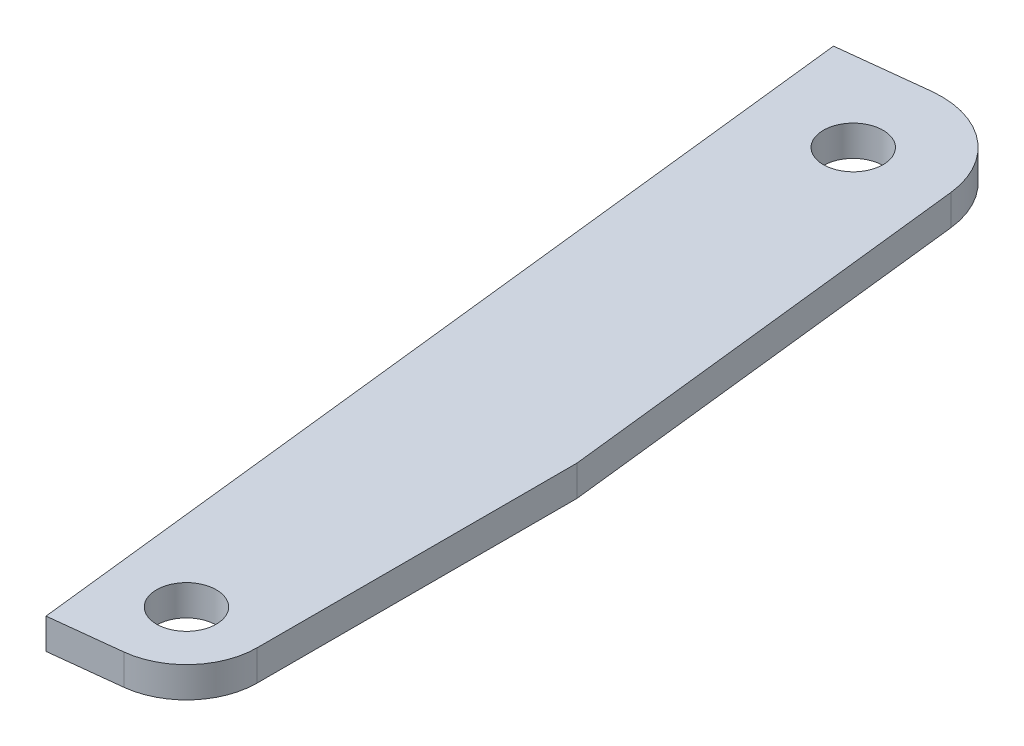
ISO-10303-21;
HEADER;
FILE_DESCRIPTION(('STEP AP214'),'2;1');
FILE_NAME('part.step','',(''),(''),'','','');
FILE_SCHEMA(('AUTOMOTIVE_DESIGN { 1 0 10303 214 1 1 1 1 }'));
ENDSEC;
DATA;
#1=APPLICATION_CONTEXT('core data for automotive mechanical design processes');
#2=APPLICATION_PROTOCOL_DEFINITION('international standard','automotive_design',2000,#1);
#3=PRODUCT_CONTEXT('',#1,'mechanical');
#4=PRODUCT('Part','Part','',(#3));
#5=PRODUCT_RELATED_PRODUCT_CATEGORY('part','',(#4));
#6=PRODUCT_DEFINITION_FORMATION('','',#4);
#7=PRODUCT_DEFINITION_CONTEXT('part definition',#1,'design');
#8=PRODUCT_DEFINITION('design','',#6,#7);
#9=PRODUCT_DEFINITION_SHAPE('','',#8);
#10=(LENGTH_UNIT() NAMED_UNIT(*) SI_UNIT(.MILLI.,.METRE.));
#11=(NAMED_UNIT(*) PLANE_ANGLE_UNIT() SI_UNIT($,.RADIAN.));
#12=(NAMED_UNIT(*) SI_UNIT($,.STERADIAN.) SOLID_ANGLE_UNIT());
#13=UNCERTAINTY_MEASURE_WITH_UNIT(LENGTH_MEASURE(1.E-05),#10,'distance_accuracy_value','');
#14=(GEOMETRIC_REPRESENTATION_CONTEXT(3) GLOBAL_UNCERTAINTY_ASSIGNED_CONTEXT((#13)) GLOBAL_UNIT_ASSIGNED_CONTEXT((#10,
#11,#12)) REPRESENTATION_CONTEXT('',''));
#15=CARTESIAN_POINT('',(0.,0.,0.));
#16=DIRECTION('',(0.,0.,1.));
#17=DIRECTION('',(1.,0.,0.));
#18=AXIS2_PLACEMENT_3D('',#15,#16,#17);
#19=CARTESIAN_POINT('',(-15.9902564771226,-15.2624999999999,81.9598120914848));
#20=DIRECTION('',(0.,1.,0.));
#21=DIRECTION('',(0.,0.,1.));
#22=AXIS2_PLACEMENT_3D('',#19,#20,#21);
#23=PLANE('',#22);
#24=CARTESIAN_POINT('',(-17.3400495431374,-15.2624999999999,56.0398397293865));
#25=DIRECTION('',(0.,1.,0.));
#26=DIRECTION('',(0.,0.,1.));
#27=AXIS2_PLACEMENT_3D('',#24,#25,#26);
#28=CIRCLE('',#27,2.1463);
#29=CARTESIAN_POINT('',(-17.3400495431374,-15.2624999999999,58.1861397293865));
#30=VERTEX_POINT('',#29);
#31=EDGE_CURVE('E97',#30,#30,#28,.T.);
#32=ORIENTED_EDGE('',*,*,#31,.T.);
#33=EDGE_LOOP('',(#32));
#34=FACE_BOUND('',#33,.T.);
#35=CARTESIAN_POINT('',(-12.7000000000016,-15.2624999999999,108.613413739759));
#36=DIRECTION('',(0.,1.,0.));
#37=DIRECTION('',(0.,0.,1.));
#38=AXIS2_PLACEMENT_3D('',#35,#36,#37);
#39=CIRCLE('',#38,2.1463);
#40=CARTESIAN_POINT('',(-12.7000000000016,-15.2624999999999,110.759713739759));
#41=VERTEX_POINT('',#40);
#42=EDGE_CURVE('E104',#41,#41,#39,.T.);
#43=ORIENTED_EDGE('',*,*,#42,.T.);
#44=EDGE_LOOP('',(#43));
#45=FACE_BOUND('',#44,.T.);
#46=DIRECTION('',(0.993723873054751,0.,-0.111860914179466));
#47=VECTOR('',#46,1.);
#48=CARTESIAN_POINT('',(-12.1317465559698,-15.2624999999999,113.661531014878));
#49=LINE('',#48,#47);
#50=CARTESIAN_POINT('',(-17.179863831088,-15.2624999999999,114.229784458909));
#51=VERTEX_POINT('',#50);
#52=CARTESIAN_POINT('',(-12.1317465559699,-15.2624999999999,113.661531014878));
#53=VERTEX_POINT('',#52);
#54=EDGE_CURVE('E129',#51,#53,#49,.T.);
#55=ORIENTED_EDGE('',*,*,#54,.F.);
#56=DIRECTION('',(0.111860914179471,0.,0.99372387305475));
#57=VECTOR('',#56,1.);
#58=CARTESIAN_POINT('',(-17.179863831088,-15.2624999999999,114.229784458909));
#59=LINE('',#58,#57);
#60=CARTESIAN_POINT('',(-24.3605129896851,-15.2624999999999,50.4400099405282));
#61=VERTEX_POINT('',#60);
#62=EDGE_CURVE('E102',#61,#51,#59,.T.);
#63=ORIENTED_EDGE('',*,*,#62,.F.);
#64=DIRECTION('',(-0.99372387305475,0.,0.111860914179472));
#65=VECTOR('',#64,1.);
#66=CARTESIAN_POINT('',(-24.3605129896851,-15.2624999999999,50.4400099405282));
#67=LINE('',#66,#65);
#68=CARTESIAN_POINT('',(-18.05036637228,-15.2624999999999,49.7296931328424));
#69=VERTEX_POINT('',#68);
#70=EDGE_CURVE('E74',#69,#61,#67,.T.);
#71=ORIENTED_EDGE('',*,*,#70,.F.);
#72=CARTESIAN_POINT('',(-17.3400495431374,-15.2624999999999,56.0398397293865));
#73=DIRECTION('',(0.,-1.,0.));
#74=DIRECTION('',(0.,0.,-1.));
#75=AXIS2_PLACEMENT_3D('',#72,#73,#74);
#76=CIRCLE('',#75,6.35000000532595);
#77=CARTESIAN_POINT('',(-11.0299029440473,-15.2624999999999,55.3295229228615));
#78=VERTEX_POINT('',#77);
#79=EDGE_CURVE('E20',#78,#69,#76,.F.);
#80=ORIENTED_EDGE('',*,*,#79,.F.);
#81=DIRECTION('',(-0.111860913626176,0.,-0.993723873117033));
#82=VECTOR('',#81,1.);
#83=CARTESIAN_POINT('',(-11.0299029445429,-15.2624999999999,55.3295229184585));
#84=LINE('',#83,#82);
#85=CARTESIAN_POINT('',(-7.61999998818669,-15.2624999999999,85.6216230513364));
#86=VERTEX_POINT('',#85);
#87=EDGE_CURVE('E61',#86,#78,#84,.T.);
#88=ORIENTED_EDGE('',*,*,#87,.F.);
#89=DIRECTION('',(0.,0.,-1.));
#90=VECTOR('',#89,1.);
#91=CARTESIAN_POINT('',(-7.61999999999997,-15.2624999999999,85.6216230526662));
#92=LINE('',#91,#90);
#93=CARTESIAN_POINT('',(-7.62000000000157,-15.2624999999999,108.61341373976));
#94=VERTEX_POINT('',#93);
#95=EDGE_CURVE('E140',#94,#86,#92,.T.);
#96=ORIENTED_EDGE('',*,*,#95,.F.);
#97=CARTESIAN_POINT('',(-12.7000000000016,-15.2624999999999,108.613413739759));
#98=DIRECTION('',(0.,-1.,0.));
#99=DIRECTION('',(0.,0.,-1.));
#100=AXIS2_PLACEMENT_3D('',#97,#98,#99);
#101=CIRCLE('',#100,5.08);
#102=EDGE_CURVE('E137',#53,#94,#101,.F.);
#103=ORIENTED_EDGE('',*,*,#102,.F.);
#104=EDGE_LOOP('',(#55,#63,#71,#80,#88,#96,#103));
#105=FACE_BOUND('',#104,.T.);
#106=ADVANCED_FACE('F17',(#34,#45,#105),#23,.F.);
#107=CARTESIAN_POINT('',(-17.179863831088,-13.0625,114.229784458909));
#108=DIRECTION('',(-0.99372387305475,0.,0.111860914179471));
#109=DIRECTION('',(0.111860914179471,0.,0.99372387305475));
#110=AXIS2_PLACEMENT_3D('',#107,#108,#109);
#111=PLANE('',#110);
#112=DIRECTION('',(-0.111860914179471,0.,-0.99372387305475));
#113=VECTOR('',#112,1.);
#114=CARTESIAN_POINT('',(-17.179863831088,-13.0625,114.229784458909));
#115=LINE('',#114,#113);
#116=CARTESIAN_POINT('',(-17.179863831088,-13.0625,114.229784458909));
#117=VERTEX_POINT('',#116);
#118=CARTESIAN_POINT('',(-24.3605129896851,-13.0625,50.4400099405282));
#119=VERTEX_POINT('',#118);
#120=EDGE_CURVE('E86',#117,#119,#115,.T.);
#121=ORIENTED_EDGE('',*,*,#120,.T.);
#122=DIRECTION('',(0.,1.,0.));
#123=VECTOR('',#122,1.);
#124=CARTESIAN_POINT('',(-24.3605129896851,-13.0625,50.4400099405282));
#125=LINE('',#124,#123);
#126=EDGE_CURVE('E147',#61,#119,#125,.T.);
#127=ORIENTED_EDGE('',*,*,#126,.F.);
#128=ORIENTED_EDGE('',*,*,#62,.T.);
#129=DIRECTION('',(0.,1.,0.));
#130=VECTOR('',#129,1.);
#131=CARTESIAN_POINT('',(-17.179863831088,-13.0625,114.229784458909));
#132=LINE('',#131,#130);
#133=EDGE_CURVE('E100',#117,#51,#132,.F.);
#134=ORIENTED_EDGE('',*,*,#133,.F.);
#135=EDGE_LOOP('',(#121,#127,#128,#134));
#136=FACE_BOUND('',#135,.T.);
#137=ADVANCED_FACE('F101',(#136),#111,.T.);
#138=CARTESIAN_POINT('',(-24.3605129896851,-13.0625,50.4400099405282));
#139=DIRECTION('',(-0.111860914179472,0.,-0.99372387305475));
#140=DIRECTION('',(-0.99372387305475,0.,0.111860914179472));
#141=AXIS2_PLACEMENT_3D('',#138,#139,#140);
#142=PLANE('',#141);
#143=DIRECTION('',(0.993723873054749,0.,-0.111860914179477));
#144=VECTOR('',#143,1.);
#145=CARTESIAN_POINT('',(-24.3605129896851,-13.0625,50.4400099405282));
#146=LINE('',#145,#144);
#147=CARTESIAN_POINT('',(-18.05036637228,-13.0625,49.7296931328424));
#148=VERTEX_POINT('',#147);
#149=EDGE_CURVE('E94',#119,#148,#146,.T.);
#150=ORIENTED_EDGE('',*,*,#149,.T.);
#151=DIRECTION('',(0.,-1.,0.));
#152=VECTOR('',#151,1.);
#153=CARTESIAN_POINT('',(-18.0503663957871,-13.0625,49.7296931354886));
#154=LINE('',#153,#152);
#155=EDGE_CURVE('E145',#69,#148,#154,.F.);
#156=ORIENTED_EDGE('',*,*,#155,.F.);
#157=ORIENTED_EDGE('',*,*,#70,.T.);
#158=ORIENTED_EDGE('',*,*,#126,.T.);
#159=EDGE_LOOP('',(#150,#156,#157,#158));
#160=FACE_BOUND('',#159,.T.);
#161=ADVANCED_FACE('F183',(#160),#142,.T.);
#162=CARTESIAN_POINT('',(-17.3400495431374,-13.0625,56.0398397293865));
#163=DIRECTION('',(0.,-1.,0.));
#164=DIRECTION('',(0.,0.,-1.));
#165=AXIS2_PLACEMENT_3D('',#162,#163,#164);
#166=CYLINDRICAL_SURFACE('',#165,6.35000000532595);
#167=CARTESIAN_POINT('',(-17.3400495431374,-13.0625,56.0398397293865));
#168=DIRECTION('',(0.,-1.,0.));
#169=DIRECTION('',(0.,0.,-1.));
#170=AXIS2_PLACEMENT_3D('',#167,#168,#169);
#171=CIRCLE('',#170,6.35000000532595);
#172=CARTESIAN_POINT('',(-11.0299029436318,-13.0625,55.3295229265527));
#173=VERTEX_POINT('',#172);
#174=EDGE_CURVE('E123',#148,#173,#171,.T.);
#175=ORIENTED_EDGE('',*,*,#174,.T.);
#176=DIRECTION('',(0.,1.,0.));
#177=VECTOR('',#176,1.);
#178=CARTESIAN_POINT('',(-11.0299029445429,-13.0625,55.3295229184585));
#179=LINE('',#178,#177);
#180=EDGE_CURVE('E143',#78,#173,#179,.T.);
#181=ORIENTED_EDGE('',*,*,#180,.F.);
#182=ORIENTED_EDGE('',*,*,#79,.T.);
#183=ORIENTED_EDGE('',*,*,#155,.T.);
#184=EDGE_LOOP('',(#175,#181,#182,#183));
#185=FACE_BOUND('',#184,.T.);
#186=ADVANCED_FACE('F182',(#185),#166,.T.);
#187=CARTESIAN_POINT('',(-11.0299029445429,-13.0625,55.3295229184585));
#188=DIRECTION('',(0.993723873117033,0.,-0.111860913626176));
#189=DIRECTION('',(-0.111860913626176,0.,-0.993723873117033));
#190=AXIS2_PLACEMENT_3D('',#187,#188,#189);
#191=PLANE('',#190);
#192=DIRECTION('',(0.111860912463582,0.,0.993723873247903));
#193=VECTOR('',#192,1.);
#194=CARTESIAN_POINT('',(-11.0299029445429,-13.0625,55.3295229184585));
#195=LINE('',#194,#193);
#196=CARTESIAN_POINT('',(-7.61999999999997,-13.0625,85.6216230526662));
#197=VERTEX_POINT('',#196);
#198=EDGE_CURVE('E118',#173,#197,#195,.T.);
#199=ORIENTED_EDGE('',*,*,#198,.T.);
#200=DIRECTION('',(0.,1.,0.));
#201=VECTOR('',#200,1.);
#202=CARTESIAN_POINT('',(-7.61999999999997,-13.0625,85.6216230526662));
#203=LINE('',#202,#201);
#204=EDGE_CURVE('E138',#86,#197,#203,.T.);
#205=ORIENTED_EDGE('',*,*,#204,.F.);
#206=ORIENTED_EDGE('',*,*,#87,.T.);
#207=ORIENTED_EDGE('',*,*,#180,.T.);
#208=EDGE_LOOP('',(#199,#205,#206,#207));
#209=FACE_BOUND('',#208,.T.);
#210=ADVANCED_FACE('F181',(#209),#191,.T.);
#211=CARTESIAN_POINT('',(-7.61999999999997,-13.0625,85.6216230526662));
#212=DIRECTION('',(1.,0.,0.));
#213=DIRECTION('',(0.,0.,-1.));
#214=AXIS2_PLACEMENT_3D('',#211,#212,#213);
#215=PLANE('',#214);
#216=DIRECTION('',(0.,0.,-1.));
#217=VECTOR('',#216,1.);
#218=CARTESIAN_POINT('',(-7.61999999999997,-13.0625,81.9598120914848));
#219=LINE('',#218,#217);
#220=CARTESIAN_POINT('',(-7.62000000000077,-13.0625,108.613413739759));
#221=VERTEX_POINT('',#220);
#222=EDGE_CURVE('E111',#197,#221,#219,.F.);
#223=ORIENTED_EDGE('',*,*,#222,.T.);
#224=DIRECTION('',(0.,-1.,0.));
#225=VECTOR('',#224,1.);
#226=CARTESIAN_POINT('',(-7.62000000000157,-13.0625,108.613413739759));
#227=LINE('',#226,#225);
#228=EDGE_CURVE('E135',#94,#221,#227,.F.);
#229=ORIENTED_EDGE('',*,*,#228,.F.);
#230=ORIENTED_EDGE('',*,*,#95,.T.);
#231=ORIENTED_EDGE('',*,*,#204,.T.);
#232=EDGE_LOOP('',(#223,#229,#230,#231));
#233=FACE_BOUND('',#232,.T.);
#234=ADVANCED_FACE('F178',(#233),#215,.T.);
#235=CARTESIAN_POINT('',(-12.7000000000016,-13.0625,108.613413739759));
#236=DIRECTION('',(0.,-1.,0.));
#237=DIRECTION('',(0.,0.,-1.));
#238=AXIS2_PLACEMENT_3D('',#235,#236,#237);
#239=CYLINDRICAL_SURFACE('',#238,5.08);
#240=CARTESIAN_POINT('',(-12.7000000000016,-13.0625,108.613413739759));
#241=DIRECTION('',(0.,-1.,0.));
#242=DIRECTION('',(0.,0.,-1.));
#243=AXIS2_PLACEMENT_3D('',#240,#241,#242);
#244=CIRCLE('',#243,5.08);
#245=CARTESIAN_POINT('',(-12.1317465559699,-13.0625,113.661531014878));
#246=VERTEX_POINT('',#245);
#247=EDGE_CURVE('E107',#221,#246,#244,.T.);
#248=ORIENTED_EDGE('',*,*,#247,.T.);
#249=DIRECTION('',(0.,1.,0.));
#250=VECTOR('',#249,1.);
#251=CARTESIAN_POINT('',(-12.1317465559698,-13.0625,113.661531014878));
#252=LINE('',#251,#250);
#253=EDGE_CURVE('E35',#53,#246,#252,.T.);
#254=ORIENTED_EDGE('',*,*,#253,.F.);
#255=ORIENTED_EDGE('',*,*,#102,.T.);
#256=ORIENTED_EDGE('',*,*,#228,.T.);
#257=EDGE_LOOP('',(#248,#254,#255,#256));
#258=FACE_BOUND('',#257,.T.);
#259=ADVANCED_FACE('F174',(#258),#239,.T.);
#260=CARTESIAN_POINT('',(-12.1317465559698,-13.0625,113.661531014878));
#261=DIRECTION('',(0.111860914179466,0.,0.993723873054751));
#262=DIRECTION('',(0.993723873054751,0.,-0.111860914179466));
#263=AXIS2_PLACEMENT_3D('',#260,#261,#262);
#264=PLANE('',#263);
#265=DIRECTION('',(-0.993723873054753,0.,0.11186091417945));
#266=VECTOR('',#265,1.);
#267=CARTESIAN_POINT('',(-12.1317465559698,-13.0625,113.661531014878));
#268=LINE('',#267,#266);
#269=EDGE_CURVE('E90',#246,#117,#268,.T.);
#270=ORIENTED_EDGE('',*,*,#269,.T.);
#271=ORIENTED_EDGE('',*,*,#133,.T.);
#272=ORIENTED_EDGE('',*,*,#54,.T.);
#273=ORIENTED_EDGE('',*,*,#253,.T.);
#274=EDGE_LOOP('',(#270,#271,#272,#273));
#275=FACE_BOUND('',#274,.T.);
#276=ADVANCED_FACE('F106',(#275),#264,.T.);
#277=CARTESIAN_POINT('',(-12.7000000000016,-2.85875000000017,108.613413739759));
#278=DIRECTION('',(0.,1.,0.));
#279=DIRECTION('',(0.,0.,1.));
#280=AXIS2_PLACEMENT_3D('',#277,#278,#279);
#281=CYLINDRICAL_SURFACE('',#280,2.1463);
#282=CARTESIAN_POINT('',(-12.7000000000016,-13.0625,108.613413739759));
#283=DIRECTION('',(0.,1.,0.));
#284=DIRECTION('',(0.,0.,1.));
#285=AXIS2_PLACEMENT_3D('',#282,#283,#284);
#286=CIRCLE('',#285,2.1463);
#287=CARTESIAN_POINT('',(-12.7000000000016,-13.0625,110.759713739759));
#288=VERTEX_POINT('',#287);
#289=EDGE_CURVE('E26',#288,#288,#286,.T.);
#290=ORIENTED_EDGE('',*,*,#289,.T.);
#291=EDGE_LOOP('',(#290));
#292=FACE_BOUND('',#291,.T.);
#293=ORIENTED_EDGE('',*,*,#42,.F.);
#294=EDGE_LOOP('',(#293));
#295=FACE_BOUND('',#294,.T.);
#296=ADVANCED_FACE('F199',(#292,#295),#281,.F.);
#297=CARTESIAN_POINT('',(-17.3400495431374,-2.85875000000017,56.0398397293865));
#298=DIRECTION('',(0.,1.,0.));
#299=DIRECTION('',(0.,0.,1.));
#300=AXIS2_PLACEMENT_3D('',#297,#298,#299);
#301=CYLINDRICAL_SURFACE('',#300,2.1463);
#302=CARTESIAN_POINT('',(-17.3400495431374,-13.0625,56.0398397293865));
#303=DIRECTION('',(0.,1.,0.));
#304=DIRECTION('',(0.,0.,1.));
#305=AXIS2_PLACEMENT_3D('',#302,#303,#304);
#306=CIRCLE('',#305,2.1463);
#307=CARTESIAN_POINT('',(-17.3400495431374,-13.0625,58.1861397293865));
#308=VERTEX_POINT('',#307);
#309=EDGE_CURVE('E11',#308,#308,#306,.T.);
#310=ORIENTED_EDGE('',*,*,#309,.T.);
#311=EDGE_LOOP('',(#310));
#312=FACE_BOUND('',#311,.T.);
#313=ORIENTED_EDGE('',*,*,#31,.F.);
#314=EDGE_LOOP('',(#313));
#315=FACE_BOUND('',#314,.T.);
#316=ADVANCED_FACE('F193',(#312,#315),#301,.F.);
#317=CARTESIAN_POINT('',(-15.9902564771226,-13.0625,81.9598120914848));
#318=DIRECTION('',(0.,-1.,0.));
#319=DIRECTION('',(0.,0.,-1.));
#320=AXIS2_PLACEMENT_3D('',#317,#318,#319);
#321=PLANE('',#320);
#322=ORIENTED_EDGE('',*,*,#309,.F.);
#323=EDGE_LOOP('',(#322));
#324=FACE_BOUND('',#323,.T.);
#325=ORIENTED_EDGE('',*,*,#289,.F.);
#326=EDGE_LOOP('',(#325));
#327=FACE_BOUND('',#326,.T.);
#328=ORIENTED_EDGE('',*,*,#247,.F.);
#329=ORIENTED_EDGE('',*,*,#222,.F.);
#330=ORIENTED_EDGE('',*,*,#198,.F.);
#331=ORIENTED_EDGE('',*,*,#174,.F.);
#332=ORIENTED_EDGE('',*,*,#149,.F.);
#333=ORIENTED_EDGE('',*,*,#120,.F.);
#334=ORIENTED_EDGE('',*,*,#269,.F.);
#335=EDGE_LOOP('',(#328,#329,#330,#331,#332,#333,#334));
#336=FACE_BOUND('',#335,.T.);
#337=ADVANCED_FACE('F89',(#324,#327,#336),#321,.F.);
#338=CLOSED_SHELL('',(#106,#137,#161,#186,#210,#234,#259,#276,#296,#316,#337));
#339=MANIFOLD_SOLID_BREP('B1',#338);
#340=ADVANCED_BREP_SHAPE_REPRESENTATION('',(#18,#339),#14);
#341=SHAPE_DEFINITION_REPRESENTATION(#9,#340);
ENDSEC;
END-ISO-10303-21;
